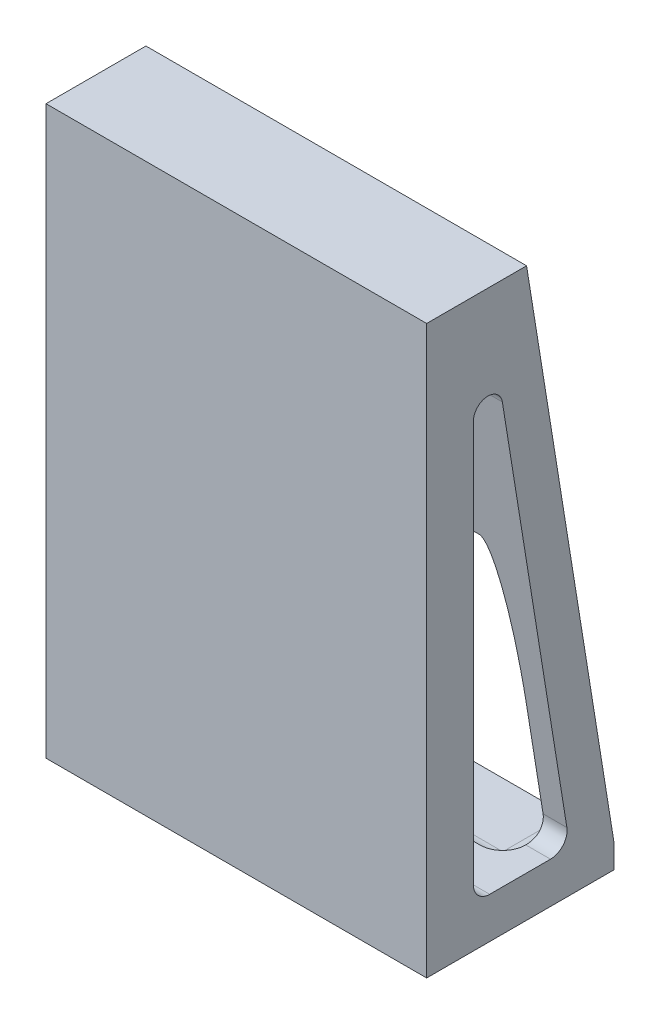
ISO-10303-21;
HEADER;
FILE_DESCRIPTION(('STEP AP214'),'2;1');
FILE_NAME('part.step','',(''),(''),'','','');
FILE_SCHEMA(('AUTOMOTIVE_DESIGN { 1 0 10303 214 1 1 1 1 }'));
ENDSEC;
DATA;
#1=APPLICATION_CONTEXT('core data for automotive mechanical design processes');
#2=APPLICATION_PROTOCOL_DEFINITION('international standard','automotive_design',2000,#1);
#3=PRODUCT_CONTEXT('',#1,'mechanical');
#4=PRODUCT('Part','Part','',(#3));
#5=PRODUCT_RELATED_PRODUCT_CATEGORY('part','',(#4));
#6=PRODUCT_DEFINITION_FORMATION('','',#4);
#7=PRODUCT_DEFINITION_CONTEXT('part definition',#1,'design');
#8=PRODUCT_DEFINITION('design','',#6,#7);
#9=PRODUCT_DEFINITION_SHAPE('','',#8);
#10=(LENGTH_UNIT() NAMED_UNIT(*) SI_UNIT(.MILLI.,.METRE.));
#11=(NAMED_UNIT(*) PLANE_ANGLE_UNIT() SI_UNIT($,.RADIAN.));
#12=(NAMED_UNIT(*) SI_UNIT($,.STERADIAN.) SOLID_ANGLE_UNIT());
#13=UNCERTAINTY_MEASURE_WITH_UNIT(LENGTH_MEASURE(1.E-05),#10,'distance_accuracy_value','');
#14=(GEOMETRIC_REPRESENTATION_CONTEXT(3) GLOBAL_UNCERTAINTY_ASSIGNED_CONTEXT((#13)) GLOBAL_UNIT_ASSIGNED_CONTEXT((#10,
#11,#12)) REPRESENTATION_CONTEXT('',''));
#15=CARTESIAN_POINT('',(0.,0.,0.));
#16=DIRECTION('',(0.,0.,1.));
#17=DIRECTION('',(1.,0.,0.));
#18=AXIS2_PLACEMENT_3D('',#15,#16,#17);
#19=CARTESIAN_POINT('',(-76.2,-100.,-40.));
#20=DIRECTION('',(0.,0.,-1.));
#21=DIRECTION('',(-1.,0.,0.));
#22=AXIS2_PLACEMENT_3D('',#19,#20,#21);
#23=PLANE('',#22);
#24=DIRECTION('',(1.,0.,0.));
#25=VECTOR('',#24,1.);
#26=CARTESIAN_POINT('',(-76.2,76.4465667258123,-40.));
#27=LINE('',#26,#25);
#28=CARTESIAN_POINT('',(-57.15,76.4465667258123,-40.));
#29=VERTEX_POINT('',#28);
#30=CARTESIAN_POINT('',(57.15,76.4465667258123,-40.));
#31=VERTEX_POINT('',#30);
#32=EDGE_CURVE('E460',#29,#31,#27,.T.);
#33=ORIENTED_EDGE('',*,*,#32,.F.);
#34=DIRECTION('',(0.,1.,0.));
#35=VECTOR('',#34,1.);
#36=CARTESIAN_POINT('',(-57.15,-100.,-40.));
#37=LINE('',#36,#35);
#38=CARTESIAN_POINT('',(-57.15,179.05,-40.));
#39=VERTEX_POINT('',#38);
#40=EDGE_CURVE('E389',#29,#39,#37,.T.);
#41=ORIENTED_EDGE('',*,*,#40,.T.);
#42=DIRECTION('',(-1.,0.,0.));
#43=VECTOR('',#42,1.);
#44=CARTESIAN_POINT('',(-76.2,179.05,-40.));
#45=LINE('',#44,#43);
#46=CARTESIAN_POINT('',(57.1499999999999,179.05,-40.));
#47=VERTEX_POINT('',#46);
#48=EDGE_CURVE('E368',#47,#39,#45,.T.);
#49=ORIENTED_EDGE('',*,*,#48,.F.);
#50=DIRECTION('',(0.,-1.,0.));
#51=VECTOR('',#50,1.);
#52=CARTESIAN_POINT('',(57.15,-100.,-40.));
#53=LINE('',#52,#51);
#54=EDGE_CURVE('E386',#47,#31,#53,.T.);
#55=ORIENTED_EDGE('',*,*,#54,.T.);
#56=EDGE_LOOP('',(#33,#41,#49,#55));
#57=FACE_BOUND('',#56,.T.);
#58=ADVANCED_FACE('F34',(#57),#23,.T.);
#59=CARTESIAN_POINT('',(151.802418116089,-38.3699999999991,0.));
#60=DIRECTION('',(0.,-1.,0.));
#61=DIRECTION('',(0.,0.,-1.));
#62=AXIS2_PLACEMENT_3D('',#59,#60,#61);
#63=PLANE('',#62);
#64=DIRECTION('',(-1.,0.,0.));
#65=VECTOR('',#64,1.);
#66=CARTESIAN_POINT('',(151.802418116089,-38.3699999999991,-75.));
#67=LINE('',#66,#65);
#68=CARTESIAN_POINT('',(57.1500000000001,-38.3699999999991,-75.));
#69=VERTEX_POINT('',#68);
#70=CARTESIAN_POINT('',(-57.1499999999999,-38.3699999999991,-75.));
#71=VERTEX_POINT('',#70);
#72=EDGE_CURVE('E440',#69,#71,#67,.T.);
#73=ORIENTED_EDGE('',*,*,#72,.T.);
#74=DIRECTION('',(0.,0.,-1.));
#75=VECTOR('',#74,1.);
#76=CARTESIAN_POINT('',(-57.15,-38.3699999999991,-40.));
#77=LINE('',#76,#75);
#78=CARTESIAN_POINT('',(-57.15,-38.3699999999991,-49.525));
#79=VERTEX_POINT('',#78);
#80=EDGE_CURVE('E383',#71,#79,#77,.F.);
#81=ORIENTED_EDGE('',*,*,#80,.T.);
#82=DIRECTION('',(-1.,0.,0.));
#83=VECTOR('',#82,1.);
#84=CARTESIAN_POINT('',(151.802418116089,-38.3699999999991,-49.525));
#85=LINE('',#84,#83);
#86=CARTESIAN_POINT('',(57.15,-38.3699999999991,-49.525));
#87=VERTEX_POINT('',#86);
#88=EDGE_CURVE('E380',#79,#87,#85,.F.);
#89=ORIENTED_EDGE('',*,*,#88,.T.);
#90=DIRECTION('',(0.,0.,1.));
#91=VECTOR('',#90,1.);
#92=CARTESIAN_POINT('',(57.15,-38.3699999999991,-75.));
#93=LINE('',#92,#91);
#94=EDGE_CURVE('E377',#87,#69,#93,.F.);
#95=ORIENTED_EDGE('',*,*,#94,.T.);
#96=EDGE_LOOP('',(#73,#81,#89,#95));
#97=FACE_BOUND('',#96,.T.);
#98=ADVANCED_FACE('F313',(#97),#63,.F.);
#99=CARTESIAN_POINT('',(-76.2,-100.,-40.));
#100=DIRECTION('',(-1.,0.,0.));
#101=DIRECTION('',(0.,0.,1.));
#102=AXIS2_PLACEMENT_3D('',#99,#100,#101);
#103=PLANE('',#102);
#104=DIRECTION('',(0.,0.987289431968938,0.158932619441234));
#105=VECTOR('',#104,1.);
#106=CARTESIAN_POINT('',(-76.2,-23.7877288341215,-56.1355916870467));
#107=LINE('',#106,#105);
#108=CARTESIAN_POINT('',(-76.2,-23.7877288341215,-56.1355916870467));
#109=VERTEX_POINT('',#108);
#110=CARTESIAN_POINT('',(-76.2,136.694946031077,-30.3012911614191));
#111=VERTEX_POINT('',#110);
#112=EDGE_CURVE('E224',#109,#111,#107,.T.);
#113=ORIENTED_EDGE('',*,*,#112,.T.);
#114=CARTESIAN_POINT('',(-76.2,135.766936654167,-24.5364969120537));
#115=DIRECTION('',(-1.,0.,0.));
#116=DIRECTION('',(0.,0.,1.));
#117=AXIS2_PLACEMENT_3D('',#114,#115,#116);
#118=CIRCLE('',#117,5.83901140101212);
#119=CARTESIAN_POINT('',(-76.2,135.766936654167,-18.6974855110415));
#120=VERTEX_POINT('',#119);
#121=EDGE_CURVE('E207',#120,#111,#118,.T.);
#122=ORIENTED_EDGE('',*,*,#121,.F.);
#123=DIRECTION('',(0.,-1.,0.));
#124=VECTOR('',#123,1.);
#125=CARTESIAN_POINT('',(-76.2,135.766936654167,-18.6974855110415));
#126=LINE('',#125,#124);
#127=CARTESIAN_POINT('',(-76.2,-24.9482584561402,-18.6974855110416));
#128=VERTEX_POINT('',#127);
#129=EDGE_CURVE('E236',#120,#128,#126,.T.);
#130=ORIENTED_EDGE('',*,*,#129,.T.);
#131=CARTESIAN_POINT('',(-76.2,-24.9482584561402,-25.2367462859917));
#132=DIRECTION('',(-1.,0.,0.));
#133=DIRECTION('',(0.,0.,1.));
#134=AXIS2_PLACEMENT_3D('',#131,#132,#133);
#135=CIRCLE('',#134,6.53926077495014);
#136=CARTESIAN_POINT('',(-76.2,-31.4875192310904,-25.2367462859917));
#137=VERTEX_POINT('',#136);
#138=EDGE_CURVE('E197',#128,#137,#135,.F.);
#139=ORIENTED_EDGE('',*,*,#138,.T.);
#140=DIRECTION('',(0.,0.,-1.));
#141=VECTOR('',#140,1.);
#142=CARTESIAN_POINT('',(-76.2,-31.4875192310904,-25.2367462859917));
#143=LINE('',#142,#141);
#144=CARTESIAN_POINT('',(-76.2,-31.4875192310904,-49.5761752379969));
#145=VERTEX_POINT('',#144);
#146=EDGE_CURVE('E194',#137,#145,#143,.T.);
#147=ORIENTED_EDGE('',*,*,#146,.T.);
#148=CARTESIAN_POINT('',(-76.2,-24.8436555000986,-49.5761752379969));
#149=DIRECTION('',(-1.,0.,0.));
#150=DIRECTION('',(0.,0.,1.));
#151=AXIS2_PLACEMENT_3D('',#148,#149,#150);
#152=CIRCLE('',#151,6.64386373099175);
#153=EDGE_CURVE('E228',#145,#109,#152,.F.);
#154=ORIENTED_EDGE('',*,*,#153,.T.);
#155=EDGE_LOOP('',(#113,#122,#130,#139,#147,#154));
#156=FACE_BOUND('',#155,.T.);
#157=DIRECTION('',(0.,0.,1.));
#158=VECTOR('',#157,1.);
#159=CARTESIAN_POINT('',(-76.2,179.05,-40.));
#160=LINE('',#159,#158);
#161=CARTESIAN_POINT('',(-76.2,179.05,-40.));
#162=VERTEX_POINT('',#161);
#163=CARTESIAN_POINT('',(-76.2,179.05,0.));
#164=VERTEX_POINT('',#163);
#165=EDGE_CURVE('E356',#162,#164,#160,.T.);
#166=ORIENTED_EDGE('',*,*,#165,.F.);
#167=DIRECTION('',(0.,-0.987289431968938,-0.158932619441233));
#168=VECTOR('',#167,1.);
#169=CARTESIAN_POINT('',(-76.2,179.05,-40.));
#170=LINE('',#169,#168);
#171=CARTESIAN_POINT('',(-76.2,-38.3699999999996,-75.));
#172=VERTEX_POINT('',#171);
#173=EDGE_CURVE('E419',#162,#172,#170,.T.);
#174=ORIENTED_EDGE('',*,*,#173,.T.);
#175=DIRECTION('',(0.,1.,0.));
#176=VECTOR('',#175,1.);
#177=CARTESIAN_POINT('',(-76.2,-38.3699999999991,-75.));
#178=LINE('',#177,#176);
#179=CARTESIAN_POINT('',(-76.2,-47.8949999999991,-75.));
#180=VERTEX_POINT('',#179);
#181=EDGE_CURVE('E353',#180,#172,#178,.T.);
#182=ORIENTED_EDGE('',*,*,#181,.F.);
#183=DIRECTION('',(0.,0.,-1.));
#184=VECTOR('',#183,1.);
#185=CARTESIAN_POINT('',(-76.2,-47.8949999999991,-40.));
#186=LINE('',#185,#184);
#187=CARTESIAN_POINT('',(-76.2,-47.8949999999991,0.));
#188=VERTEX_POINT('',#187);
#189=EDGE_CURVE('E351',#188,#180,#186,.T.);
#190=ORIENTED_EDGE('',*,*,#189,.F.);
#191=DIRECTION('',(0.,1.,0.));
#192=VECTOR('',#191,1.);
#193=CARTESIAN_POINT('',(-76.2,-100.,0.));
#194=LINE('',#193,#192);
#195=EDGE_CURVE('E337',#188,#164,#194,.T.);
#196=ORIENTED_EDGE('',*,*,#195,.T.);
#197=EDGE_LOOP('',(#166,#174,#182,#190,#196));
#198=FACE_BOUND('',#197,.T.);
#199=ADVANCED_FACE('F287',(#156,#198),#103,.T.);
#200=CARTESIAN_POINT('',(76.2,-100.,-40.));
#201=DIRECTION('',(1.,0.,0.));
#202=DIRECTION('',(0.,0.,-1.));
#203=AXIS2_PLACEMENT_3D('',#200,#201,#202);
#204=PLANE('',#203);
#205=DIRECTION('',(0.,0.987289431968938,0.158932619441234));
#206=VECTOR('',#205,1.);
#207=CARTESIAN_POINT('',(76.2,-23.7877288341215,-56.1355916870467));
#208=LINE('',#207,#206);
#209=CARTESIAN_POINT('',(76.2,-23.7877288341215,-56.1355916870467));
#210=VERTEX_POINT('',#209);
#211=CARTESIAN_POINT('',(76.2,136.694946031077,-30.3012911614191));
#212=VERTEX_POINT('',#211);
#213=EDGE_CURVE('E218',#210,#212,#208,.T.);
#214=ORIENTED_EDGE('',*,*,#213,.F.);
#215=CARTESIAN_POINT('',(76.2,-24.8436555000986,-49.5761752379969));
#216=DIRECTION('',(1.,0.,0.));
#217=DIRECTION('',(0.,0.,-1.));
#218=AXIS2_PLACEMENT_3D('',#215,#216,#217);
#219=CIRCLE('',#218,6.64386373099175);
#220=CARTESIAN_POINT('',(76.2,-31.4875192310904,-49.5761752379969));
#221=VERTEX_POINT('',#220);
#222=EDGE_CURVE('E215',#221,#210,#219,.T.);
#223=ORIENTED_EDGE('',*,*,#222,.F.);
#224=DIRECTION('',(0.,0.,-1.));
#225=VECTOR('',#224,1.);
#226=CARTESIAN_POINT('',(76.2,-31.4875192310904,-25.2367462859917));
#227=LINE('',#226,#225);
#228=CARTESIAN_POINT('',(76.2,-31.4875192310904,-25.2367462859917));
#229=VERTEX_POINT('',#228);
#230=EDGE_CURVE('E58',#229,#221,#227,.T.);
#231=ORIENTED_EDGE('',*,*,#230,.F.);
#232=CARTESIAN_POINT('',(76.2,-24.9482584561402,-25.2367462859917));
#233=DIRECTION('',(1.,0.,0.));
#234=DIRECTION('',(0.,0.,-1.));
#235=AXIS2_PLACEMENT_3D('',#232,#233,#234);
#236=CIRCLE('',#235,6.53926077495014);
#237=CARTESIAN_POINT('',(76.2,-24.9482584561402,-18.6974855110416));
#238=VERTEX_POINT('',#237);
#239=EDGE_CURVE('E200',#238,#229,#236,.T.);
#240=ORIENTED_EDGE('',*,*,#239,.F.);
#241=DIRECTION('',(0.,-1.,0.));
#242=VECTOR('',#241,1.);
#243=CARTESIAN_POINT('',(76.2,135.766936654167,-18.6974855110415));
#244=LINE('',#243,#242);
#245=CARTESIAN_POINT('',(76.2,135.766936654167,-18.6974855110415));
#246=VERTEX_POINT('',#245);
#247=EDGE_CURVE('E208',#246,#238,#244,.T.);
#248=ORIENTED_EDGE('',*,*,#247,.F.);
#249=CARTESIAN_POINT('',(76.2,135.766936654167,-24.5364969120537));
#250=DIRECTION('',(1.,0.,0.));
#251=DIRECTION('',(0.,0.,-1.));
#252=AXIS2_PLACEMENT_3D('',#249,#250,#251);
#253=CIRCLE('',#252,5.83901140101212);
#254=EDGE_CURVE('E216',#246,#212,#253,.F.);
#255=ORIENTED_EDGE('',*,*,#254,.T.);
#256=EDGE_LOOP('',(#214,#223,#231,#240,#248,#255));
#257=FACE_BOUND('',#256,.T.);
#258=DIRECTION('',(0.,-0.987289431968938,-0.158932619441233));
#259=VECTOR('',#258,1.);
#260=CARTESIAN_POINT('',(76.2,179.05,-40.));
#261=LINE('',#260,#259);
#262=CARTESIAN_POINT('',(76.2,179.05,-40.));
#263=VERTEX_POINT('',#262);
#264=CARTESIAN_POINT('',(76.2,-38.3699999999991,-75.));
#265=VERTEX_POINT('',#264);
#266=EDGE_CURVE('E429',#263,#265,#261,.T.);
#267=ORIENTED_EDGE('',*,*,#266,.F.);
#268=DIRECTION('',(0.,0.,-1.));
#269=VECTOR('',#268,1.);
#270=CARTESIAN_POINT('',(76.2,179.05,-40.));
#271=LINE('',#270,#269);
#272=CARTESIAN_POINT('',(76.2,179.05,0.));
#273=VERTEX_POINT('',#272);
#274=EDGE_CURVE('E366',#273,#263,#271,.T.);
#275=ORIENTED_EDGE('',*,*,#274,.F.);
#276=DIRECTION('',(0.,1.,0.));
#277=VECTOR('',#276,1.);
#278=CARTESIAN_POINT('',(76.2,-100.,0.));
#279=LINE('',#278,#277);
#280=CARTESIAN_POINT('',(76.2,-47.8949999999991,0.));
#281=VERTEX_POINT('',#280);
#282=EDGE_CURVE('E346',#281,#273,#279,.T.);
#283=ORIENTED_EDGE('',*,*,#282,.F.);
#284=DIRECTION('',(0.,0.,1.));
#285=VECTOR('',#284,1.);
#286=CARTESIAN_POINT('',(76.2,-47.8949999999991,-40.));
#287=LINE('',#286,#285);
#288=CARTESIAN_POINT('',(76.2,-47.8949999999991,-75.));
#289=VERTEX_POINT('',#288);
#290=EDGE_CURVE('E357',#289,#281,#287,.T.);
#291=ORIENTED_EDGE('',*,*,#290,.F.);
#292=DIRECTION('',(0.,1.,0.));
#293=VECTOR('',#292,1.);
#294=CARTESIAN_POINT('',(76.2,-38.3699999999991,-75.));
#295=LINE('',#294,#293);
#296=EDGE_CURVE('E361',#289,#265,#295,.T.);
#297=ORIENTED_EDGE('',*,*,#296,.T.);
#298=EDGE_LOOP('',(#267,#275,#283,#291,#297));
#299=FACE_BOUND('',#298,.T.);
#300=ADVANCED_FACE('F212',(#257,#299),#204,.T.);
#301=CARTESIAN_POINT('',(-76.2,-100.,0.));
#302=DIRECTION('',(0.,0.,1.));
#303=DIRECTION('',(1.,0.,0.));
#304=AXIS2_PLACEMENT_3D('',#301,#302,#303);
#305=PLANE('',#304);
#306=ORIENTED_EDGE('',*,*,#195,.F.);
#307=DIRECTION('',(-1.,0.,0.));
#308=VECTOR('',#307,1.);
#309=CARTESIAN_POINT('',(-76.2,-47.8949999999991,0.));
#310=LINE('',#309,#308);
#311=EDGE_CURVE('E340',#281,#188,#310,.T.);
#312=ORIENTED_EDGE('',*,*,#311,.F.);
#313=ORIENTED_EDGE('',*,*,#282,.T.);
#314=DIRECTION('',(1.,0.,0.));
#315=VECTOR('',#314,1.);
#316=CARTESIAN_POINT('',(-76.2,179.05,0.));
#317=LINE('',#316,#315);
#318=EDGE_CURVE('E342',#164,#273,#317,.T.);
#319=ORIENTED_EDGE('',*,*,#318,.F.);
#320=EDGE_LOOP('',(#306,#312,#313,#319));
#321=FACE_BOUND('',#320,.T.);
#322=ADVANCED_FACE('F327',(#321),#305,.T.);
#323=CARTESIAN_POINT('',(0.,179.05,0.));
#324=DIRECTION('',(0.,1.,0.));
#325=DIRECTION('',(0.,0.,1.));
#326=AXIS2_PLACEMENT_3D('',#323,#324,#325);
#327=PLANE('',#326);
#328=ORIENTED_EDGE('',*,*,#318,.T.);
#329=ORIENTED_EDGE('',*,*,#274,.T.);
#330=EDGE_CURVE('E347',#263,#47,#45,.T.);
#331=ORIENTED_EDGE('',*,*,#330,.T.);
#332=ORIENTED_EDGE('',*,*,#48,.T.);
#333=DIRECTION('',(-1.,0.,0.));
#334=VECTOR('',#333,1.);
#335=CARTESIAN_POINT('',(0.,179.05,-40.));
#336=LINE('',#335,#334);
#337=EDGE_CURVE('E423',#39,#162,#336,.T.);
#338=ORIENTED_EDGE('',*,*,#337,.T.);
#339=ORIENTED_EDGE('',*,*,#165,.T.);
#340=EDGE_LOOP('',(#328,#329,#331,#332,#338,#339));
#341=FACE_BOUND('',#340,.T.);
#342=ADVANCED_FACE('F324',(#341),#327,.T.);
#343=CARTESIAN_POINT('',(0.,-47.8949999999991,0.));
#344=DIRECTION('',(0.,1.,0.));
#345=DIRECTION('',(-1.,0.,0.));
#346=AXIS2_PLACEMENT_3D('',#343,#344,#345);
#347=PLANE('',#346);
#348=ORIENTED_EDGE('',*,*,#189,.T.);
#349=DIRECTION('',(-1.,0.,0.));
#350=VECTOR('',#349,1.);
#351=CARTESIAN_POINT('',(151.802418116089,-47.8949999999991,-75.));
#352=LINE('',#351,#350);
#353=EDGE_CURVE('E435',#289,#180,#352,.T.);
#354=ORIENTED_EDGE('',*,*,#353,.F.);
#355=ORIENTED_EDGE('',*,*,#290,.T.);
#356=ORIENTED_EDGE('',*,*,#311,.T.);
#357=EDGE_LOOP('',(#348,#354,#355,#356));
#358=FACE_BOUND('',#357,.T.);
#359=ADVANCED_FACE('F333',(#358),#347,.F.);
#360=CARTESIAN_POINT('',(151.802418116089,-38.3699999999991,-75.));
#361=DIRECTION('',(0.,0.,1.));
#362=DIRECTION('',(1.,0.,0.));
#363=AXIS2_PLACEMENT_3D('',#360,#361,#362);
#364=PLANE('',#363);
#365=EDGE_CURVE('E439',#71,#172,#67,.T.);
#366=ORIENTED_EDGE('',*,*,#365,.F.);
#367=ORIENTED_EDGE('',*,*,#72,.F.);
#368=EDGE_CURVE('E438',#265,#69,#67,.T.);
#369=ORIENTED_EDGE('',*,*,#368,.F.);
#370=ORIENTED_EDGE('',*,*,#296,.F.);
#371=ORIENTED_EDGE('',*,*,#353,.T.);
#372=ORIENTED_EDGE('',*,*,#181,.T.);
#373=EDGE_LOOP('',(#366,#367,#369,#370,#371,#372));
#374=FACE_BOUND('',#373,.T.);
#375=ADVANCED_FACE('F487',(#374),#364,.F.);
#376=CARTESIAN_POINT('',(76.2,179.05,-40.));
#377=DIRECTION('',(0.,-0.158932619441233,0.987289431968938));
#378=DIRECTION('',(0.,-0.987289431968938,-0.158932619441233));
#379=AXIS2_PLACEMENT_3D('',#376,#377,#378);
#380=PLANE('',#379);
#381=ORIENTED_EDGE('',*,*,#330,.F.);
#382=ORIENTED_EDGE('',*,*,#266,.T.);
#383=ORIENTED_EDGE('',*,*,#368,.T.);
#384=CARTESIAN_POINT('',(57.15,-28.8449999999991,-73.4666773985834));
#385=DIRECTION('',(0.,-0.158932619441233,0.987289431968938));
#386=DIRECTION('',(0.,-0.987289431968938,-0.158932619441233));
#387=AXIS2_PLACEMENT_3D('',#384,#385,#386);
#388=ELLIPSE('',#387,9.64762681699572,9.525);
#389=CARTESIAN_POINT('',(66.675,-28.8449999999991,-73.4666773985834));
#390=VERTEX_POINT('',#389);
#391=EDGE_CURVE('E401',#69,#390,#388,.T.);
#392=ORIENTED_EDGE('',*,*,#391,.T.);
#393=DIRECTION('',(0.,-0.987289431968938,-0.158932619441233));
#394=VECTOR('',#393,1.);
#395=CARTESIAN_POINT('',(66.675,179.05,-40.));
#396=LINE('',#395,#394);
#397=CARTESIAN_POINT('',(66.675,119.8807,-49.525));
#398=VERTEX_POINT('',#397);
#399=EDGE_CURVE('E428',#398,#390,#396,.T.);
#400=ORIENTED_EDGE('',*,*,#399,.F.);
#401=CARTESIAN_POINT('',(57.15,119.8807,-49.525));
#402=DIRECTION('',(0.,-0.158932619441233,0.987289431968938));
#403=DIRECTION('',(0.,-0.987289431968938,-0.158932619441233));
#404=AXIS2_PLACEMENT_3D('',#401,#402,#403);
#405=ELLIPSE('',#404,59.9310577871772,9.525);
#406=EDGE_CURVE('E276',#398,#47,#405,.T.);
#407=ORIENTED_EDGE('',*,*,#406,.T.);
#408=EDGE_LOOP('',(#381,#382,#383,#392,#400,#407));
#409=FACE_BOUND('',#408,.T.);
#410=ADVANCED_FACE('F478',(#409),#380,.F.);
#411=CARTESIAN_POINT('',(66.675,65.5775000000004,-37.5));
#412=DIRECTION('',(1.,0.,0.));
#413=DIRECTION('',(0.,0.,-1.));
#414=AXIS2_PLACEMENT_3D('',#411,#412,#413);
#415=PLANE('',#414);
#416=CARTESIAN_POINT('',(66.675,-24.8436555000986,-49.5761752379969));
#417=DIRECTION('',(1.,0.,0.));
#418=DIRECTION('',(0.,0.,-1.));
#419=AXIS2_PLACEMENT_3D('',#416,#417,#418);
#420=CIRCLE('',#419,6.64386373099175);
#421=CARTESIAN_POINT('',(66.675,-28.8449999999991,-54.879963268179));
#422=VERTEX_POINT('',#421);
#423=CARTESIAN_POINT('',(66.675,-23.7877288341215,-56.1355916870467));
#424=VERTEX_POINT('',#423);
#425=EDGE_CURVE('E257',#422,#424,#420,.T.);
#426=ORIENTED_EDGE('',*,*,#425,.T.);
#427=DIRECTION('',(0.,0.987289431968938,0.158932619441234));
#428=VECTOR('',#427,1.);
#429=CARTESIAN_POINT('',(66.675,66.2443292724815,-41.6423434406521));
#430=LINE('',#429,#428);
#431=CARTESIAN_POINT('',(66.675,17.2772667258126,-49.525));
#432=VERTEX_POINT('',#431);
#433=EDGE_CURVE('E409',#424,#432,#430,.T.);
#434=ORIENTED_EDGE('',*,*,#433,.T.);
#435=DIRECTION('',(0.,-1.,0.));
#436=VECTOR('',#435,1.);
#437=CARTESIAN_POINT('',(66.675,65.5775000000004,-49.525));
#438=LINE('',#437,#436);
#439=EDGE_CURVE('E391',#432,#398,#438,.F.);
#440=ORIENTED_EDGE('',*,*,#439,.T.);
#441=ORIENTED_EDGE('',*,*,#399,.T.);
#442=DIRECTION('',(0.,0.,1.));
#443=VECTOR('',#442,1.);
#444=CARTESIAN_POINT('',(66.675,-28.8449999999991,-40.));
#445=LINE('',#444,#443);
#446=EDGE_CURVE('E393',#390,#422,#445,.T.);
#447=ORIENTED_EDGE('',*,*,#446,.T.);
#448=EDGE_LOOP('',(#426,#434,#440,#441,#447));
#449=FACE_BOUND('',#448,.T.);
#450=ADVANCED_FACE('F473',(#449),#415,.F.);
#451=CARTESIAN_POINT('',(-76.2,179.05,-40.));
#452=DIRECTION('',(0.,0.158932619441233,-0.987289431968938));
#453=DIRECTION('',(0.,-0.987289431968938,-0.158932619441233));
#454=AXIS2_PLACEMENT_3D('',#451,#452,#453);
#455=PLANE('',#454);
#456=ORIENTED_EDGE('',*,*,#337,.F.);
#457=CARTESIAN_POINT('',(-57.15,119.8807,-49.525));
#458=DIRECTION('',(0.,0.158932619441233,-0.987289431968938));
#459=DIRECTION('',(0.,0.987289431968938,0.158932619441233));
#460=AXIS2_PLACEMENT_3D('',#457,#458,#459);
#461=ELLIPSE('',#460,59.9310577871772,9.525);
#462=CARTESIAN_POINT('',(-66.675,119.8807,-49.525));
#463=VERTEX_POINT('',#462);
#464=EDGE_CURVE('E399',#39,#463,#461,.F.);
#465=ORIENTED_EDGE('',*,*,#464,.T.);
#466=DIRECTION('',(0.,-0.987289431968938,-0.158932619441233));
#467=VECTOR('',#466,1.);
#468=CARTESIAN_POINT('',(-66.675,179.05,-40.));
#469=LINE('',#468,#467);
#470=CARTESIAN_POINT('',(-66.675,-28.8449999999991,-73.4666773985834));
#471=VERTEX_POINT('',#470);
#472=EDGE_CURVE('E415',#463,#471,#469,.T.);
#473=ORIENTED_EDGE('',*,*,#472,.T.);
#474=CARTESIAN_POINT('',(-57.15,-28.8449999999991,-73.4666773985834));
#475=DIRECTION('',(0.,0.158932619441233,-0.987289431968938));
#476=DIRECTION('',(0.,0.987289431968938,0.158932619441233));
#477=AXIS2_PLACEMENT_3D('',#474,#475,#476);
#478=ELLIPSE('',#477,9.64762681699572,9.525);
#479=EDGE_CURVE('E396',#471,#71,#478,.F.);
#480=ORIENTED_EDGE('',*,*,#479,.T.);
#481=ORIENTED_EDGE('',*,*,#365,.T.);
#482=ORIENTED_EDGE('',*,*,#173,.F.);
#483=EDGE_LOOP('',(#456,#465,#473,#480,#481,#482));
#484=FACE_BOUND('',#483,.T.);
#485=ADVANCED_FACE('F446',(#484),#455,.T.);
#486=CARTESIAN_POINT('',(-66.675,65.5775000000004,-37.5));
#487=DIRECTION('',(-1.,0.,0.));
#488=DIRECTION('',(0.,0.,1.));
#489=AXIS2_PLACEMENT_3D('',#486,#487,#488);
#490=PLANE('',#489);
#491=DIRECTION('',(0.,1.,0.));
#492=VECTOR('',#491,1.);
#493=CARTESIAN_POINT('',(-66.675,65.5775000000004,-49.525));
#494=LINE('',#493,#492);
#495=CARTESIAN_POINT('',(-66.675,17.2772667258126,-49.525));
#496=VERTEX_POINT('',#495);
#497=EDGE_CURVE('E372',#463,#496,#494,.F.);
#498=ORIENTED_EDGE('',*,*,#497,.T.);
#499=DIRECTION('',(0.,-0.987289431968938,-0.158932619441234));
#500=VECTOR('',#499,1.);
#501=CARTESIAN_POINT('',(-66.675,66.2443292724815,-41.6423434406521));
#502=LINE('',#501,#500);
#503=CARTESIAN_POINT('',(-66.675,-23.7877288341215,-56.1355916870467));
#504=VERTEX_POINT('',#503);
#505=EDGE_CURVE('E462',#496,#504,#502,.T.);
#506=ORIENTED_EDGE('',*,*,#505,.T.);
#507=CARTESIAN_POINT('',(-66.675,-24.8436555000986,-49.5761752379969));
#508=DIRECTION('',(-1.,0.,0.));
#509=DIRECTION('',(0.,0.,1.));
#510=AXIS2_PLACEMENT_3D('',#507,#508,#509);
#511=CIRCLE('',#510,6.64386373099175);
#512=CARTESIAN_POINT('',(-66.675,-28.8449999999991,-54.879963268179));
#513=VERTEX_POINT('',#512);
#514=EDGE_CURVE('E246',#504,#513,#511,.T.);
#515=ORIENTED_EDGE('',*,*,#514,.T.);
#516=DIRECTION('',(0.,0.,-1.));
#517=VECTOR('',#516,1.);
#518=CARTESIAN_POINT('',(-66.675,-28.8449999999991,-75.));
#519=LINE('',#518,#517);
#520=EDGE_CURVE('E375',#513,#471,#519,.T.);
#521=ORIENTED_EDGE('',*,*,#520,.T.);
#522=ORIENTED_EDGE('',*,*,#472,.F.);
#523=EDGE_LOOP('',(#498,#506,#515,#521,#522));
#524=FACE_BOUND('',#523,.T.);
#525=ADVANCED_FACE('F309',(#524),#490,.F.);
#526=CARTESIAN_POINT('',(57.15,-28.8449999999991,-37.5));
#527=DIRECTION('',(0.,0.,-1.));
#528=DIRECTION('',(-1.,0.,0.));
#529=AXIS2_PLACEMENT_3D('',#526,#527,#528);
#530=CYLINDRICAL_SURFACE('',#529,9.525);
#531=CARTESIAN_POINT('',(57.15,-28.8449999999991,-49.525));
#532=DIRECTION('',(0.,0.,-1.));
#533=DIRECTION('',(-1.,0.,0.));
#534=AXIS2_PLACEMENT_3D('',#531,#532,#533);
#535=CIRCLE('',#534,9.525);
#536=CARTESIAN_POINT('',(66.3011046936046,-31.4875192310904,-49.525));
#537=VERTEX_POINT('',#536);
#538=EDGE_CURVE('E277',#537,#87,#535,.T.);
#539=ORIENTED_EDGE('',*,*,#538,.F.);
#540=DIRECTION('',(0.,0.,-1.));
#541=VECTOR('',#540,1.);
#542=CARTESIAN_POINT('',(66.3011046936046,-31.4875192310904,-37.5));
#543=LINE('',#542,#541);
#544=CARTESIAN_POINT('',(66.3011046936046,-31.4875192310904,-49.5761752379969));
#545=VERTEX_POINT('',#544);
#546=EDGE_CURVE('E467',#537,#545,#543,.T.);
#547=ORIENTED_EDGE('',*,*,#546,.T.);
#548=CARTESIAN_POINT('',(66.3011046936046,-31.4875192310904,-49.5761752379969));
#549=CARTESIAN_POINT('',(66.3010539765599,-31.4875434387314,-49.7607242771203));
#550=CARTESIAN_POINT('',(66.3033236109761,-31.4798309341544,-49.9452601627318));
#551=CARTESIAN_POINT('',(66.312133010924,-31.4491144379655,-50.3129023749204));
#552=CARTESIAN_POINT('',(66.3186715819832,-31.426114723768,-50.4960090868897));
#553=CARTESIAN_POINT('',(66.3356339307802,-31.3650586078804,-50.859178903787));
#554=CARTESIAN_POINT('',(66.3460509433604,-31.3270284167549,-51.0392467410409));
#555=CARTESIAN_POINT('',(66.370077920066,-31.2362351423646,-51.3954118868989));
#556=CARTESIAN_POINT('',(66.3836879930091,-31.1834715569825,-51.5715090599607));
#557=CARTESIAN_POINT('',(66.413209203414,-31.0636431128625,-51.918471286085));
#558=CARTESIAN_POINT('',(66.4291192475658,-30.9965850419779,-52.0893387786176));
#559=CARTESIAN_POINT('',(66.4621953044499,-30.8485952466634,-52.4249064631238));
#560=CARTESIAN_POINT('',(66.4793618217688,-30.767657930757,-52.5896041367761));
#561=CARTESIAN_POINT('',(66.5137470172333,-30.5925167185154,-52.9116009907534));
#562=CARTESIAN_POINT('',(66.5309656344256,-30.4983248444024,-53.0689067051814));
#563=CARTESIAN_POINT('',(66.5641978906937,-30.2972070057752,-53.3752974908322));
#564=CARTESIAN_POINT('',(66.5802112213333,-30.1902777996999,-53.5243804552396));
#565=CARTESIAN_POINT('',(66.6181096881437,-29.8997534531531,-53.8958561679545));
#566=CARTESIAN_POINT('',(66.6381387104502,-29.7072011684233,-54.1115960038052));
#567=CARTESIAN_POINT('',(66.6594729779263,-29.398372488638,-54.4152251524168));
#568=CARTESIAN_POINT('',(66.6651334221597,-29.2920454885653,-54.5131431004636));
#569=CARTESIAN_POINT('',(66.672898432372,-29.0731160581426,-54.7019411485634));
#570=CARTESIAN_POINT('',(66.6750014393931,-28.9605108988625,-54.7928181464591));
#571=CARTESIAN_POINT('',(66.675,-28.8449999999991,-54.879963268179));
#572=B_SPLINE_CURVE_WITH_KNOTS('',3,(#548,#549,#550,#551,#552,#553,#554,#555,#556,#557,#558,
#559,#560,#561,#562,#563,#564,#565,#566,#567,#568,#569,#570,#571),.UNSPECIFIED.,.F.,.F.,(4,2,2,
2,2,2,2,2,2,2,2,4),(0.,0.553451562803945,1.10674833308622,1.6590844763235,2.21143944559731,
2.7635327065746,3.31584891197094,3.8676673434181,4.41962651001171,5.28621630294124,
5.7198895658891,6.15375282610902),.UNSPECIFIED.);
#573=EDGE_CURVE('E249',#545,#422,#572,.T.);
#574=ORIENTED_EDGE('',*,*,#573,.T.);
#575=ORIENTED_EDGE('',*,*,#446,.F.);
#576=ORIENTED_EDGE('',*,*,#391,.F.);
#577=ORIENTED_EDGE('',*,*,#94,.F.);
#578=EDGE_LOOP('',(#539,#547,#574,#575,#576,#577));
#579=FACE_BOUND('',#578,.T.);
#580=ADVANCED_FACE('F36',(#579),#530,.F.);
#581=CARTESIAN_POINT('',(57.15,-100.,-49.525));
#582=DIRECTION('',(0.,-1.,0.));
#583=DIRECTION('',(0.,0.,-1.));
#584=AXIS2_PLACEMENT_3D('',#581,#582,#583);
#585=CYLINDRICAL_SURFACE('',#584,9.525);
#586=ORIENTED_EDGE('',*,*,#439,.F.);
#587=CARTESIAN_POINT('',(57.15,17.2772667258126,-49.525));
#588=DIRECTION('',(0.,0.158932619441234,-0.987289431968938));
#589=DIRECTION('',(0.,-0.987289431968938,-0.158932619441234));
#590=AXIS2_PLACEMENT_3D('',#587,#588,#589);
#591=ELLIPSE('',#590,59.9310577871771,9.525);
#592=EDGE_CURVE('E464',#432,#31,#591,.F.);
#593=ORIENTED_EDGE('',*,*,#592,.T.);
#594=ORIENTED_EDGE('',*,*,#54,.F.);
#595=ORIENTED_EDGE('',*,*,#406,.F.);
#596=EDGE_LOOP('',(#586,#593,#594,#595));
#597=FACE_BOUND('',#596,.T.);
#598=ADVANCED_FACE('F302',(#597),#585,.F.);
#599=CARTESIAN_POINT('',(57.15,-28.8449999999991,-49.525));
#600=DIRECTION('',(0.,0.,1.));
#601=DIRECTION('',(1.,0.,0.));
#602=AXIS2_PLACEMENT_3D('',#599,#600,#601);
#603=SPHERICAL_SURFACE('',#602,9.525);
#604=CARTESIAN_POINT('',(57.15,-28.8449999999991,-49.525));
#605=DIRECTION('',(-1.,0.,0.));
#606=DIRECTION('',(0.,0.,1.));
#607=AXIS2_PLACEMENT_3D('',#604,#605,#606);
#608=CIRCLE('',#607,9.525);
#609=CARTESIAN_POINT('',(57.15,-31.4875192310904,-40.3738953063954));
#610=VERTEX_POINT('',#609);
#611=EDGE_CURVE('E410',#610,#87,#608,.F.);
#612=ORIENTED_EDGE('',*,*,#611,.F.);
#613=CARTESIAN_POINT('',(57.15,-31.4875192310904,-49.525));
#614=DIRECTION('',(0.,-1.,0.));
#615=DIRECTION('',(0.,0.,-1.));
#616=AXIS2_PLACEMENT_3D('',#613,#614,#615);
#617=CIRCLE('',#616,9.15110469360464);
#618=EDGE_CURVE('E484',#610,#537,#617,.F.);
#619=ORIENTED_EDGE('',*,*,#618,.T.);
#620=ORIENTED_EDGE('',*,*,#538,.T.);
#621=EDGE_LOOP('',(#612,#619,#620));
#622=FACE_BOUND('',#621,.T.);
#623=ADVANCED_FACE('F299',(#622),#603,.F.);
#624=CARTESIAN_POINT('',(-76.2,-28.8449999999991,-49.525));
#625=DIRECTION('',(-1.,0.,0.));
#626=DIRECTION('',(0.,0.,1.));
#627=AXIS2_PLACEMENT_3D('',#624,#625,#626);
#628=CYLINDRICAL_SURFACE('',#627,9.525);
#629=CARTESIAN_POINT('',(-57.15,-28.8449999999991,-49.525));
#630=DIRECTION('',(1.,0.,0.));
#631=DIRECTION('',(0.,0.,-1.));
#632=AXIS2_PLACEMENT_3D('',#629,#630,#631);
#633=CIRCLE('',#632,9.525);
#634=CARTESIAN_POINT('',(-57.15,-31.4875192310904,-40.3738953063954));
#635=VERTEX_POINT('',#634);
#636=EDGE_CURVE('E408',#635,#79,#633,.T.);
#637=ORIENTED_EDGE('',*,*,#636,.F.);
#638=DIRECTION('',(-1.,0.,0.));
#639=VECTOR('',#638,1.);
#640=CARTESIAN_POINT('',(-76.2,-31.4875192310904,-40.3738953063954));
#641=LINE('',#640,#639);
#642=EDGE_CURVE('E485',#635,#610,#641,.F.);
#643=ORIENTED_EDGE('',*,*,#642,.T.);
#644=ORIENTED_EDGE('',*,*,#611,.T.);
#645=ORIENTED_EDGE('',*,*,#88,.F.);
#646=EDGE_LOOP('',(#637,#643,#644,#645));
#647=FACE_BOUND('',#646,.T.);
#648=ADVANCED_FACE('F295',(#647),#628,.F.);
#649=CARTESIAN_POINT('',(-57.15,-100.,-49.525));
#650=DIRECTION('',(0.,1.,0.));
#651=DIRECTION('',(0.,0.,1.));
#652=AXIS2_PLACEMENT_3D('',#649,#650,#651);
#653=CYLINDRICAL_SURFACE('',#652,9.525);
#654=ORIENTED_EDGE('',*,*,#40,.F.);
#655=CARTESIAN_POINT('',(-57.15,17.2772667258126,-49.525));
#656=DIRECTION('',(0.,0.158932619441234,-0.987289431968938));
#657=DIRECTION('',(0.,0.987289431968938,0.158932619441234));
#658=AXIS2_PLACEMENT_3D('',#655,#656,#657);
#659=ELLIPSE('',#658,59.9310577871771,9.525);
#660=EDGE_CURVE('E12',#29,#496,#659,.F.);
#661=ORIENTED_EDGE('',*,*,#660,.T.);
#662=ORIENTED_EDGE('',*,*,#497,.F.);
#663=ORIENTED_EDGE('',*,*,#464,.F.);
#664=EDGE_LOOP('',(#654,#661,#662,#663));
#665=FACE_BOUND('',#664,.T.);
#666=ADVANCED_FACE('F291',(#665),#653,.F.);
#667=CARTESIAN_POINT('',(-57.15,-28.8449999999991,-49.525));
#668=DIRECTION('',(0.,0.,1.));
#669=DIRECTION('',(1.,0.,0.));
#670=AXIS2_PLACEMENT_3D('',#667,#668,#669);
#671=SPHERICAL_SURFACE('',#670,9.525);
#672=CARTESIAN_POINT('',(-57.15,-28.8449999999991,-49.525));
#673=DIRECTION('',(0.,0.,-1.));
#674=DIRECTION('',(-1.,0.,0.));
#675=AXIS2_PLACEMENT_3D('',#672,#673,#674);
#676=CIRCLE('',#675,9.525);
#677=CARTESIAN_POINT('',(-66.3011046936046,-31.4875192310904,-49.525));
#678=VERTEX_POINT('',#677);
#679=EDGE_CURVE('E405',#678,#79,#676,.F.);
#680=ORIENTED_EDGE('',*,*,#679,.F.);
#681=CARTESIAN_POINT('',(-57.15,-31.4875192310904,-49.525));
#682=DIRECTION('',(0.,-1.,0.));
#683=DIRECTION('',(0.,0.,-1.));
#684=AXIS2_PLACEMENT_3D('',#681,#682,#683);
#685=CIRCLE('',#684,9.15110469360464);
#686=EDGE_CURVE('E669',#678,#635,#685,.F.);
#687=ORIENTED_EDGE('',*,*,#686,.T.);
#688=ORIENTED_EDGE('',*,*,#636,.T.);
#689=EDGE_LOOP('',(#680,#687,#688));
#690=FACE_BOUND('',#689,.T.);
#691=ADVANCED_FACE('F285',(#690),#671,.F.);
#692=CARTESIAN_POINT('',(-57.15,-28.8449999999991,-37.5));
#693=DIRECTION('',(0.,0.,1.));
#694=DIRECTION('',(1.,0.,0.));
#695=AXIS2_PLACEMENT_3D('',#692,#693,#694);
#696=CYLINDRICAL_SURFACE('',#695,9.525);
#697=CARTESIAN_POINT('',(-66.675,-28.8449999999991,-54.879963268179));
#698=CARTESIAN_POINT('',(-66.675008674387,-28.9922724378001,-54.768886920929));
#699=CARTESIAN_POINT('',(-66.6715847016933,-29.1348476341771,-54.6516713107069));
#700=CARTESIAN_POINT('',(-66.6592446061555,-29.4095737694114,-54.4059957433308));
#701=CARTESIAN_POINT('',(-66.6503314252874,-29.5417302494761,-54.2775418410293));
#702=CARTESIAN_POINT('',(-66.62839542724,-29.7946072107634,-54.0104525341723));
#703=CARTESIAN_POINT('',(-66.6153772255522,-29.9153403386232,-53.8718286978809));
#704=CARTESIAN_POINT('',(-66.5866049621099,-30.1448008773545,-53.5852249285962));
#705=CARTESIAN_POINT('',(-66.5708505891239,-30.253526920151,-53.4372439324721));
#706=CARTESIAN_POINT('',(-66.5379698927234,-30.4581898243595,-53.1330698165716));
#707=CARTESIAN_POINT('',(-66.5208450597836,-30.554140285467,-52.9768856801938));
#708=CARTESIAN_POINT('',(-66.4864915718512,-30.7328106671365,-52.6571354198376));
#709=CARTESIAN_POINT('',(-66.4692629171319,-30.8155306224889,-52.493569315272));
#710=CARTESIAN_POINT('',(-66.4359044631205,-30.9671759088007,-52.1601544489981));
#711=CARTESIAN_POINT('',(-66.4197741201018,-31.0361080987209,-51.9903088612025));
#712=CARTESIAN_POINT('',(-66.3896824094784,-31.159723564409,-51.6454122160092));
#713=CARTESIAN_POINT('',(-66.3757198583253,-31.2144146265226,-51.4703640616972));
#714=CARTESIAN_POINT('',(-66.3534952943254,-31.2991359387681,-51.153698455399));
#715=CARTESIAN_POINT('',(-66.3446522726934,-31.3319360588224,-51.0128558999153));
#716=CARTESIAN_POINT('',(-66.329222756228,-31.3882941968744,-50.7292275323491));
#717=CARTESIAN_POINT('',(-66.3226358886146,-31.4118537417675,-50.586442045351));
#718=CARTESIAN_POINT('',(-66.3119856103988,-31.4496213402034,-50.2994313900566));
#719=CARTESIAN_POINT('',(-66.3079241949389,-31.4638220006251,-50.1552051747222));
#720=CARTESIAN_POINT('',(-66.3024736488756,-31.4827767840456,-49.8660460843851));
#721=CARTESIAN_POINT('',(-66.3010852123352,-31.4875284535391,-49.7211130356379));
#722=CARTESIAN_POINT('',(-66.3011046936046,-31.4875192310904,-49.5761752379969));
#723=B_SPLINE_CURVE_WITH_KNOTS('',3,(#697,#698,#699,#700,#701,#702,#703,#704,#705,#706,#707,
#708,#709,#710,#711,#712,#713,#714,#715,#716,#717,#718,#719,#720,#721,#722),.UNSPECIFIED.,.F.,
.F.,(4,2,2,2,2,2,2,2,2,2,2,2,4),(0.,0.553125236617789,1.10595427992619,1.65816395145181,
2.21043647640831,2.76211632131464,3.31379471551994,3.86519798150704,4.41629913136353,
4.85063657547037,5.28490222019773,5.71951050643606,6.15423162742159),.UNSPECIFIED.);
#724=CARTESIAN_POINT('',(-66.3011046936046,-31.4875192310904,-49.5761752379969));
#725=VERTEX_POINT('',#724);
#726=EDGE_CURVE('E268',#513,#725,#723,.T.);
#727=ORIENTED_EDGE('',*,*,#726,.T.);
#728=DIRECTION('',(0.,0.,1.));
#729=VECTOR('',#728,1.);
#730=CARTESIAN_POINT('',(-66.3011046936046,-31.4875192310904,-37.5));
#731=LINE('',#730,#729);
#732=EDGE_CURVE('E43',#725,#678,#731,.T.);
#733=ORIENTED_EDGE('',*,*,#732,.T.);
#734=ORIENTED_EDGE('',*,*,#679,.T.);
#735=ORIENTED_EDGE('',*,*,#80,.F.);
#736=ORIENTED_EDGE('',*,*,#479,.F.);
#737=ORIENTED_EDGE('',*,*,#520,.F.);
#738=EDGE_LOOP('',(#727,#733,#734,#735,#736,#737));
#739=FACE_BOUND('',#738,.T.);
#740=ADVANCED_FACE('F279',(#739),#696,.F.);
#741=CARTESIAN_POINT('',(-253.313778219503,-23.7877288341215,-56.1355916870467));
#742=DIRECTION('',(0.,0.158932619441234,-0.987289431968938));
#743=DIRECTION('',(0.,0.987289431968938,0.158932619441234));
#744=AXIS2_PLACEMENT_3D('',#741,#742,#743);
#745=PLANE('',#744);
#746=DIRECTION('',(1.,0.,0.));
#747=VECTOR('',#746,1.);
#748=CARTESIAN_POINT('',(-253.313778219503,-23.7877288341215,-56.1355916870467));
#749=LINE('',#748,#747);
#750=EDGE_CURVE('E231',#424,#210,#749,.T.);
#751=ORIENTED_EDGE('',*,*,#750,.T.);
#752=ORIENTED_EDGE('',*,*,#213,.T.);
#753=DIRECTION('',(1.,0.,0.));
#754=VECTOR('',#753,1.);
#755=CARTESIAN_POINT('',(-253.313778219503,136.694946031077,-30.3012911614191));
#756=LINE('',#755,#754);
#757=EDGE_CURVE('E227',#111,#212,#756,.T.);
#758=ORIENTED_EDGE('',*,*,#757,.F.);
#759=ORIENTED_EDGE('',*,*,#112,.F.);
#760=EDGE_CURVE('E50',#109,#504,#749,.T.);
#761=ORIENTED_EDGE('',*,*,#760,.T.);
#762=ORIENTED_EDGE('',*,*,#505,.F.);
#763=ORIENTED_EDGE('',*,*,#660,.F.);
#764=ORIENTED_EDGE('',*,*,#32,.T.);
#765=ORIENTED_EDGE('',*,*,#592,.F.);
#766=ORIENTED_EDGE('',*,*,#433,.F.);
#767=EDGE_LOOP('',(#751,#752,#758,#759,#761,#762,#763,#764,#765,#766));
#768=FACE_BOUND('',#767,.T.);
#769=ADVANCED_FACE('F284',(#768),#745,.F.);
#770=CARTESIAN_POINT('',(-253.313778219503,-31.4875192310904,-25.2367462859917));
#771=DIRECTION('',(0.,-1.,0.));
#772=DIRECTION('',(0.,0.,-1.));
#773=AXIS2_PLACEMENT_3D('',#770,#771,#772);
#774=PLANE('',#773);
#775=ORIENTED_EDGE('',*,*,#618,.F.);
#776=ORIENTED_EDGE('',*,*,#642,.F.);
#777=ORIENTED_EDGE('',*,*,#686,.F.);
#778=ORIENTED_EDGE('',*,*,#732,.F.);
#779=DIRECTION('',(1.,0.,0.));
#780=VECTOR('',#779,1.);
#781=CARTESIAN_POINT('',(-253.313778219503,-31.4875192310904,-49.5761752379969));
#782=LINE('',#781,#780);
#783=EDGE_CURVE('E232',#145,#725,#782,.T.);
#784=ORIENTED_EDGE('',*,*,#783,.F.);
#785=ORIENTED_EDGE('',*,*,#146,.F.);
#786=DIRECTION('',(1.,0.,0.));
#787=VECTOR('',#786,1.);
#788=CARTESIAN_POINT('',(-253.313778219503,-31.4875192310904,-25.2367462859917));
#789=LINE('',#788,#787);
#790=EDGE_CURVE('E189',#137,#229,#789,.T.);
#791=ORIENTED_EDGE('',*,*,#790,.T.);
#792=ORIENTED_EDGE('',*,*,#230,.T.);
#793=EDGE_CURVE('E234',#545,#221,#782,.T.);
#794=ORIENTED_EDGE('',*,*,#793,.F.);
#795=ORIENTED_EDGE('',*,*,#546,.F.);
#796=EDGE_LOOP('',(#775,#776,#777,#778,#784,#785,#791,#792,#794,#795));
#797=FACE_BOUND('',#796,.T.);
#798=ADVANCED_FACE('F191',(#797),#774,.F.);
#799=CARTESIAN_POINT('',(-253.313778219503,-24.8436555000986,-49.5761752379969));
#800=DIRECTION('',(1.,0.,0.));
#801=DIRECTION('',(0.,0.,-1.));
#802=AXIS2_PLACEMENT_3D('',#799,#800,#801);
#803=CYLINDRICAL_SURFACE('',#802,6.64386373099175);
#804=ORIENTED_EDGE('',*,*,#573,.F.);
#805=ORIENTED_EDGE('',*,*,#793,.T.);
#806=ORIENTED_EDGE('',*,*,#222,.T.);
#807=ORIENTED_EDGE('',*,*,#750,.F.);
#808=ORIENTED_EDGE('',*,*,#425,.F.);
#809=EDGE_LOOP('',(#804,#805,#806,#807,#808));
#810=FACE_BOUND('',#809,.T.);
#811=ADVANCED_FACE('F259',(#810),#803,.F.);
#812=ORIENTED_EDGE('',*,*,#760,.F.);
#813=ORIENTED_EDGE('',*,*,#153,.F.);
#814=ORIENTED_EDGE('',*,*,#783,.T.);
#815=ORIENTED_EDGE('',*,*,#726,.F.);
#816=ORIENTED_EDGE('',*,*,#514,.F.);
#817=EDGE_LOOP('',(#812,#813,#814,#815,#816));
#818=FACE_BOUND('',#817,.T.);
#819=ADVANCED_FACE('F263',(#818),#803,.F.);
#820=CARTESIAN_POINT('',(-253.313778219503,135.766936654167,-24.5364969120537));
#821=DIRECTION('',(1.,0.,0.));
#822=DIRECTION('',(0.,0.,-1.));
#823=AXIS2_PLACEMENT_3D('',#820,#821,#822);
#824=CYLINDRICAL_SURFACE('',#823,5.83901140101212);
#825=ORIENTED_EDGE('',*,*,#121,.T.);
#826=ORIENTED_EDGE('',*,*,#757,.T.);
#827=ORIENTED_EDGE('',*,*,#254,.F.);
#828=DIRECTION('',(1.,0.,0.));
#829=VECTOR('',#828,1.);
#830=CARTESIAN_POINT('',(-253.313778219503,135.766936654167,-18.6974855110415));
#831=LINE('',#830,#829);
#832=EDGE_CURVE('E239',#120,#246,#831,.T.);
#833=ORIENTED_EDGE('',*,*,#832,.F.);
#834=EDGE_LOOP('',(#825,#826,#827,#833));
#835=FACE_BOUND('',#834,.T.);
#836=ADVANCED_FACE('F506',(#835),#824,.F.);
#837=CARTESIAN_POINT('',(-253.313778219503,135.766936654167,-18.6974855110415));
#838=DIRECTION('',(0.,0.,1.));
#839=DIRECTION('',(0.,-1.,0.));
#840=AXIS2_PLACEMENT_3D('',#837,#838,#839);
#841=PLANE('',#840);
#842=ORIENTED_EDGE('',*,*,#832,.T.);
#843=ORIENTED_EDGE('',*,*,#247,.T.);
#844=DIRECTION('',(1.,0.,0.));
#845=VECTOR('',#844,1.);
#846=CARTESIAN_POINT('',(-253.313778219503,-24.9482584561402,-18.6974855110416));
#847=LINE('',#846,#845);
#848=EDGE_CURVE('E203',#128,#238,#847,.T.);
#849=ORIENTED_EDGE('',*,*,#848,.F.);
#850=ORIENTED_EDGE('',*,*,#129,.F.);
#851=EDGE_LOOP('',(#842,#843,#849,#850));
#852=FACE_BOUND('',#851,.T.);
#853=ADVANCED_FACE('F509',(#852),#841,.F.);
#854=CARTESIAN_POINT('',(-253.313778219503,-24.9482584561402,-25.2367462859917));
#855=DIRECTION('',(1.,0.,0.));
#856=DIRECTION('',(0.,0.,-1.));
#857=AXIS2_PLACEMENT_3D('',#854,#855,#856);
#858=CYLINDRICAL_SURFACE('',#857,6.53926077495014);
#859=ORIENTED_EDGE('',*,*,#848,.T.);
#860=ORIENTED_EDGE('',*,*,#239,.T.);
#861=ORIENTED_EDGE('',*,*,#790,.F.);
#862=ORIENTED_EDGE('',*,*,#138,.F.);
#863=EDGE_LOOP('',(#859,#860,#861,#862));
#864=FACE_BOUND('',#863,.T.);
#865=ADVANCED_FACE('F201',(#864),#858,.F.);
#866=CLOSED_SHELL('',(#58,#98,#199,#300,#322,#342,#359,#375,#410,#450,#485,#525,#580,#598,#623,
#648,#666,#691,#740,#769,#798,#811,#819,#836,#853,#865));
#867=MANIFOLD_SOLID_BREP('B2',#866);
#868=ADVANCED_BREP_SHAPE_REPRESENTATION('',(#18,#867),#14);
#869=SHAPE_DEFINITION_REPRESENTATION(#9,#868);
ENDSEC;
END-ISO-10303-21;
